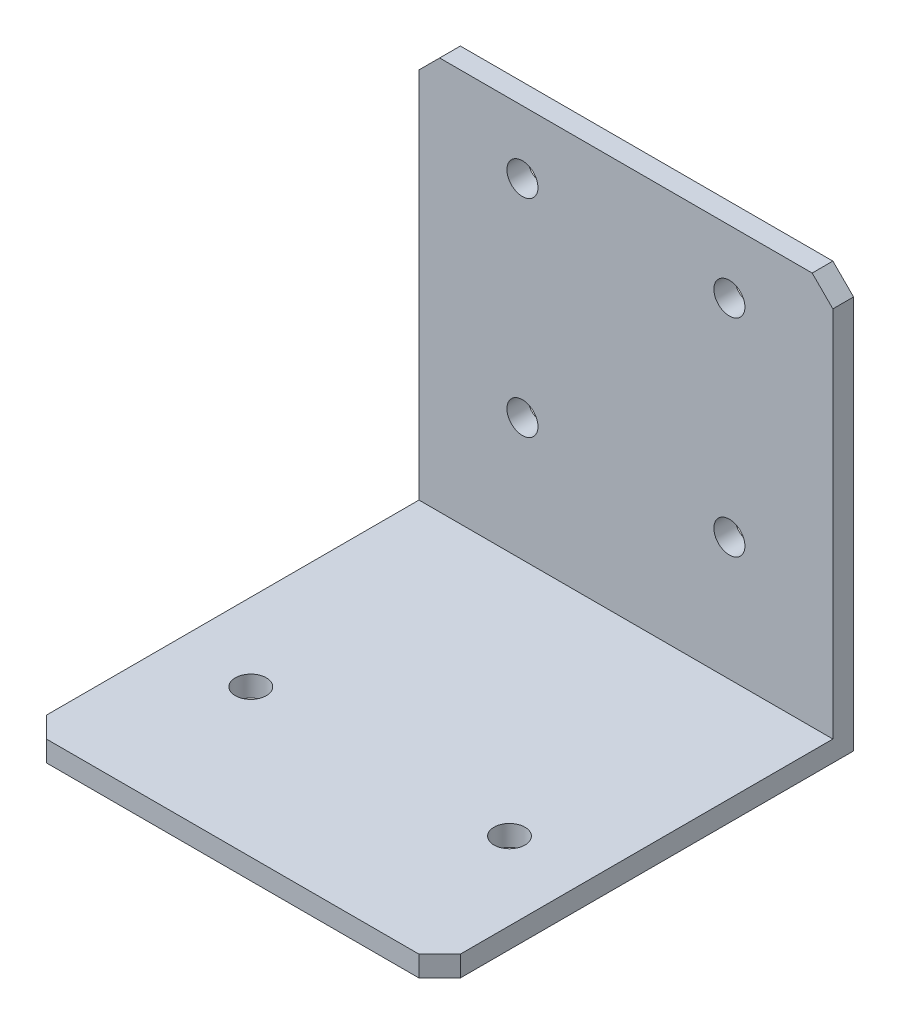
ISO-10303-21;
HEADER;
FILE_DESCRIPTION(('STEP AP214'),'2;1');
FILE_NAME('part.step','',(''),(''),'','','');
FILE_SCHEMA(('AUTOMOTIVE_DESIGN { 1 0 10303 214 1 1 1 1 }'));
ENDSEC;
DATA;
#1=APPLICATION_CONTEXT('core data for automotive mechanical design processes');
#2=APPLICATION_PROTOCOL_DEFINITION('international standard','automotive_design',2000,#1);
#3=PRODUCT_CONTEXT('',#1,'mechanical');
#4=PRODUCT('Part','Part','',(#3));
#5=PRODUCT_RELATED_PRODUCT_CATEGORY('part','',(#4));
#6=PRODUCT_DEFINITION_FORMATION('','',#4);
#7=PRODUCT_DEFINITION_CONTEXT('part definition',#1,'design');
#8=PRODUCT_DEFINITION('design','',#6,#7);
#9=PRODUCT_DEFINITION_SHAPE('','',#8);
#10=(LENGTH_UNIT() NAMED_UNIT(*) SI_UNIT(.MILLI.,.METRE.));
#11=(NAMED_UNIT(*) PLANE_ANGLE_UNIT() SI_UNIT($,.RADIAN.));
#12=(NAMED_UNIT(*) SI_UNIT($,.STERADIAN.) SOLID_ANGLE_UNIT());
#13=UNCERTAINTY_MEASURE_WITH_UNIT(LENGTH_MEASURE(1.E-05),#10,'distance_accuracy_value','');
#14=(GEOMETRIC_REPRESENTATION_CONTEXT(3) GLOBAL_UNCERTAINTY_ASSIGNED_CONTEXT((#13)) GLOBAL_UNIT_ASSIGNED_CONTEXT((#10,
#11,#12)) REPRESENTATION_CONTEXT('',''));
#15=CARTESIAN_POINT('',(0.,0.,0.));
#16=DIRECTION('',(0.,0.,1.));
#17=DIRECTION('',(1.,0.,0.));
#18=AXIS2_PLACEMENT_3D('',#15,#16,#17);
#19=CARTESIAN_POINT('',(40.,0.,38.));
#20=DIRECTION('',(0.,-1.,0.));
#21=DIRECTION('',(0.,0.,-1.));
#22=AXIS2_PLACEMENT_3D('',#19,#20,#21);
#23=PLANE('',#22);
#24=CARTESIAN_POINT('',(7.5,0.,23.75));
#25=DIRECTION('',(0.,-1.,0.));
#26=DIRECTION('',(0.,0.,-1.));
#27=AXIS2_PLACEMENT_3D('',#24,#25,#26);
#28=CIRCLE('',#27,1.49999999997635);
#29=CARTESIAN_POINT('',(7.5,0.,22.2500000000236));
#30=VERTEX_POINT('',#29);
#31=EDGE_CURVE('E213',#30,#30,#28,.F.);
#32=ORIENTED_EDGE('',*,*,#31,.F.);
#33=EDGE_LOOP('',(#32));
#34=FACE_BOUND('',#33,.T.);
#35=CARTESIAN_POINT('',(32.5,0.,23.75));
#36=DIRECTION('',(0.,-1.,0.));
#37=DIRECTION('',(0.,0.,-1.));
#38=AXIS2_PLACEMENT_3D('',#35,#36,#37);
#39=CIRCLE('',#38,1.49999999997635);
#40=CARTESIAN_POINT('',(32.5,0.,22.2500000000236));
#41=VERTEX_POINT('',#40);
#42=EDGE_CURVE('E145',#41,#41,#39,.F.);
#43=ORIENTED_EDGE('',*,*,#42,.F.);
#44=EDGE_LOOP('',(#43));
#45=FACE_BOUND('',#44,.T.);
#46=DIRECTION('',(-1.,0.,0.));
#47=VECTOR('',#46,1.);
#48=CARTESIAN_POINT('',(40.,0.,38.));
#49=LINE('',#48,#47);
#50=CARTESIAN_POINT('',(38.,0.,38.));
#51=VERTEX_POINT('',#50);
#52=CARTESIAN_POINT('',(2.00000000000001,0.,38.));
#53=VERTEX_POINT('',#52);
#54=EDGE_CURVE('E159',#51,#53,#49,.T.);
#55=ORIENTED_EDGE('',*,*,#54,.F.);
#56=DIRECTION('',(0.70710678118655,0.,-0.707106781186545));
#57=VECTOR('',#56,1.);
#58=CARTESIAN_POINT('',(40.,0.,36.));
#59=LINE('',#58,#57);
#60=CARTESIAN_POINT('',(40.,0.,36.));
#61=VERTEX_POINT('',#60);
#62=EDGE_CURVE('E176',#51,#61,#59,.T.);
#63=ORIENTED_EDGE('',*,*,#62,.T.);
#64=DIRECTION('',(0.,0.,1.));
#65=VECTOR('',#64,1.);
#66=CARTESIAN_POINT('',(40.,0.,38.));
#67=LINE('',#66,#65);
#68=CARTESIAN_POINT('',(40.,0.,0.));
#69=VERTEX_POINT('',#68);
#70=EDGE_CURVE('E123',#69,#61,#67,.T.);
#71=ORIENTED_EDGE('',*,*,#70,.F.);
#72=DIRECTION('',(-1.,0.,0.));
#73=VECTOR('',#72,1.);
#74=CARTESIAN_POINT('',(40.,0.,0.));
#75=LINE('',#74,#73);
#76=CARTESIAN_POINT('',(0.,0.,0.));
#77=VERTEX_POINT('',#76);
#78=EDGE_CURVE('E138',#69,#77,#75,.T.);
#79=ORIENTED_EDGE('',*,*,#78,.T.);
#80=DIRECTION('',(0.,0.,1.));
#81=VECTOR('',#80,1.);
#82=CARTESIAN_POINT('',(0.,0.,38.));
#83=LINE('',#82,#81);
#84=CARTESIAN_POINT('',(0.,0.,36.));
#85=VERTEX_POINT('',#84);
#86=EDGE_CURVE('E142',#77,#85,#83,.T.);
#87=ORIENTED_EDGE('',*,*,#86,.T.);
#88=DIRECTION('',(-0.707106781186545,0.,-0.70710678118655));
#89=VECTOR('',#88,1.);
#90=CARTESIAN_POINT('',(1.99999999999999,0.,38.));
#91=LINE('',#90,#89);
#92=EDGE_CURVE('E174',#85,#53,#91,.F.);
#93=ORIENTED_EDGE('',*,*,#92,.T.);
#94=EDGE_LOOP('',(#55,#63,#71,#79,#87,#93));
#95=FACE_BOUND('',#94,.T.);
#96=ADVANCED_FACE('F34',(#34,#45,#95),#23,.F.);
#97=CARTESIAN_POINT('',(40.,-2.,38.));
#98=DIRECTION('',(0.,0.,-1.));
#99=DIRECTION('',(-1.,0.,0.));
#100=AXIS2_PLACEMENT_3D('',#97,#98,#99);
#101=PLANE('',#100);
#102=DIRECTION('',(-1.,0.,0.));
#103=VECTOR('',#102,1.);
#104=CARTESIAN_POINT('',(40.,-2.,38.));
#105=LINE('',#104,#103);
#106=CARTESIAN_POINT('',(38.,-2.,38.));
#107=VERTEX_POINT('',#106);
#108=CARTESIAN_POINT('',(2.00000000000001,-2.,38.));
#109=VERTEX_POINT('',#108);
#110=EDGE_CURVE('E131',#107,#109,#105,.T.);
#111=ORIENTED_EDGE('',*,*,#110,.F.);
#112=DIRECTION('',(0.,1.,0.));
#113=VECTOR('',#112,1.);
#114=CARTESIAN_POINT('',(38.,0.,38.));
#115=LINE('',#114,#113);
#116=EDGE_CURVE('E172',#107,#51,#115,.T.);
#117=ORIENTED_EDGE('',*,*,#116,.T.);
#118=ORIENTED_EDGE('',*,*,#54,.T.);
#119=DIRECTION('',(0.,-1.,0.));
#120=VECTOR('',#119,1.);
#121=CARTESIAN_POINT('',(1.99999999999999,-2.,38.));
#122=LINE('',#121,#120);
#123=EDGE_CURVE('E169',#53,#109,#122,.T.);
#124=ORIENTED_EDGE('',*,*,#123,.T.);
#125=EDGE_LOOP('',(#111,#117,#118,#124));
#126=FACE_BOUND('',#125,.T.);
#127=ADVANCED_FACE('F277',(#126),#101,.F.);
#128=CARTESIAN_POINT('',(40.,-2.,-2.00000000000001));
#129=DIRECTION('',(0.,1.,0.));
#130=DIRECTION('',(0.,0.,1.));
#131=AXIS2_PLACEMENT_3D('',#128,#129,#130);
#132=PLANE('',#131);
#133=CARTESIAN_POINT('',(7.5,-2.,23.75));
#134=DIRECTION('',(0.,-1.,0.));
#135=DIRECTION('',(0.,0.,-1.));
#136=AXIS2_PLACEMENT_3D('',#133,#134,#135);
#137=CIRCLE('',#136,1.49999999997635);
#138=CARTESIAN_POINT('',(7.5,-2.,22.2500000000236));
#139=VERTEX_POINT('',#138);
#140=EDGE_CURVE('E216',#139,#139,#137,.T.);
#141=ORIENTED_EDGE('',*,*,#140,.F.);
#142=EDGE_LOOP('',(#141));
#143=FACE_BOUND('',#142,.T.);
#144=CARTESIAN_POINT('',(32.5,-2.,23.75));
#145=DIRECTION('',(0.,-1.,0.));
#146=DIRECTION('',(0.,0.,-1.));
#147=AXIS2_PLACEMENT_3D('',#144,#145,#146);
#148=CIRCLE('',#147,1.49999999997635);
#149=CARTESIAN_POINT('',(32.5,-2.,22.2500000000236));
#150=VERTEX_POINT('',#149);
#151=EDGE_CURVE('E210',#150,#150,#148,.T.);
#152=ORIENTED_EDGE('',*,*,#151,.F.);
#153=EDGE_LOOP('',(#152));
#154=FACE_BOUND('',#153,.T.);
#155=DIRECTION('',(0.,0.,-1.));
#156=VECTOR('',#155,1.);
#157=CARTESIAN_POINT('',(40.,-2.,-2.00000000000001));
#158=LINE('',#157,#156);
#159=CARTESIAN_POINT('',(40.,-2.,36.));
#160=VERTEX_POINT('',#159);
#161=CARTESIAN_POINT('',(40.,-2.,-2.00000000000001));
#162=VERTEX_POINT('',#161);
#163=EDGE_CURVE('E112',#160,#162,#158,.T.);
#164=ORIENTED_EDGE('',*,*,#163,.F.);
#165=DIRECTION('',(-0.70710678118655,0.,0.707106781186545));
#166=VECTOR('',#165,1.);
#167=CARTESIAN_POINT('',(40.,-2.,36.));
#168=LINE('',#167,#166);
#169=EDGE_CURVE('E167',#160,#107,#168,.T.);
#170=ORIENTED_EDGE('',*,*,#169,.T.);
#171=ORIENTED_EDGE('',*,*,#110,.T.);
#172=DIRECTION('',(0.707106781186545,0.,0.70710678118655));
#173=VECTOR('',#172,1.);
#174=CARTESIAN_POINT('',(1.99999999999999,-2.,38.));
#175=LINE('',#174,#173);
#176=CARTESIAN_POINT('',(0.,-2.,36.));
#177=VERTEX_POINT('',#176);
#178=EDGE_CURVE('E165',#109,#177,#175,.F.);
#179=ORIENTED_EDGE('',*,*,#178,.T.);
#180=DIRECTION('',(0.,0.,-1.));
#181=VECTOR('',#180,1.);
#182=CARTESIAN_POINT('',(0.,-2.,-2.00000000000001));
#183=LINE('',#182,#181);
#184=CARTESIAN_POINT('',(0.,-2.,-2.00000000000001));
#185=VERTEX_POINT('',#184);
#186=EDGE_CURVE('E129',#177,#185,#183,.T.);
#187=ORIENTED_EDGE('',*,*,#186,.T.);
#188=DIRECTION('',(-1.,0.,0.));
#189=VECTOR('',#188,1.);
#190=CARTESIAN_POINT('',(40.,-2.,-2.00000000000001));
#191=LINE('',#190,#189);
#192=EDGE_CURVE('E126',#162,#185,#191,.T.);
#193=ORIENTED_EDGE('',*,*,#192,.F.);
#194=EDGE_LOOP('',(#164,#170,#171,#179,#187,#193));
#195=FACE_BOUND('',#194,.T.);
#196=ADVANCED_FACE('F127',(#143,#154,#195),#132,.F.);
#197=CARTESIAN_POINT('',(40.,38.,-2.));
#198=DIRECTION('',(0.,0.,1.));
#199=DIRECTION('',(0.,-1.,0.));
#200=AXIS2_PLACEMENT_3D('',#197,#198,#199);
#201=PLANE('',#200);
#202=CARTESIAN_POINT('',(9.99999999999981,11.9,-2.));
#203=DIRECTION('',(0.,0.,-1.));
#204=DIRECTION('',(0.,1.,0.));
#205=AXIS2_PLACEMENT_3D('',#202,#203,#204);
#206=CIRCLE('',#205,1.5);
#207=CARTESIAN_POINT('',(9.99999999999981,13.4,-2.));
#208=VERTEX_POINT('',#207);
#209=EDGE_CURVE('E240',#208,#208,#206,.T.);
#210=ORIENTED_EDGE('',*,*,#209,.F.);
#211=EDGE_LOOP('',(#210));
#212=FACE_BOUND('',#211,.T.);
#213=CARTESIAN_POINT('',(29.9999999999998,11.8999999999999,-2.));
#214=DIRECTION('',(0.,0.,-1.));
#215=DIRECTION('',(0.,1.,0.));
#216=AXIS2_PLACEMENT_3D('',#213,#214,#215);
#217=CIRCLE('',#216,1.5);
#218=CARTESIAN_POINT('',(29.9999999999998,13.3999999999999,-2.));
#219=VERTEX_POINT('',#218);
#220=EDGE_CURVE('E234',#219,#219,#217,.T.);
#221=ORIENTED_EDGE('',*,*,#220,.F.);
#222=EDGE_LOOP('',(#221));
#223=FACE_BOUND('',#222,.T.);
#224=CARTESIAN_POINT('',(30.,31.8999999999999,-2.));
#225=DIRECTION('',(0.,0.,-1.));
#226=DIRECTION('',(0.,1.,0.));
#227=AXIS2_PLACEMENT_3D('',#224,#225,#226);
#228=CIRCLE('',#227,1.5);
#229=CARTESIAN_POINT('',(30.,33.3999999999999,-2.));
#230=VERTEX_POINT('',#229);
#231=EDGE_CURVE('E228',#230,#230,#228,.T.);
#232=ORIENTED_EDGE('',*,*,#231,.F.);
#233=EDGE_LOOP('',(#232));
#234=FACE_BOUND('',#233,.T.);
#235=CARTESIAN_POINT('',(10.,31.9,-2.));
#236=DIRECTION('',(0.,0.,-1.));
#237=DIRECTION('',(0.,1.,0.));
#238=AXIS2_PLACEMENT_3D('',#235,#236,#237);
#239=CIRCLE('',#238,1.5);
#240=CARTESIAN_POINT('',(10.,33.4,-2.));
#241=VERTEX_POINT('',#240);
#242=EDGE_CURVE('E222',#241,#241,#239,.T.);
#243=ORIENTED_EDGE('',*,*,#242,.F.);
#244=EDGE_LOOP('',(#243));
#245=FACE_BOUND('',#244,.T.);
#246=DIRECTION('',(0.,1.,0.));
#247=VECTOR('',#246,1.);
#248=CARTESIAN_POINT('',(0.,38.,-2.));
#249=LINE('',#248,#247);
#250=CARTESIAN_POINT('',(0.,36.,-2.));
#251=VERTEX_POINT('',#250);
#252=EDGE_CURVE('E147',#185,#251,#249,.T.);
#253=ORIENTED_EDGE('',*,*,#252,.T.);
#254=DIRECTION('',(-0.707106781186545,-0.70710678118655,0.));
#255=VECTOR('',#254,1.);
#256=CARTESIAN_POINT('',(1.99999999999999,38.,-2.));
#257=LINE('',#256,#255);
#258=CARTESIAN_POINT('',(2.00000000000001,38.,-2.));
#259=VERTEX_POINT('',#258);
#260=EDGE_CURVE('E11',#251,#259,#257,.F.);
#261=ORIENTED_EDGE('',*,*,#260,.T.);
#262=DIRECTION('',(-1.,0.,0.));
#263=VECTOR('',#262,1.);
#264=CARTESIAN_POINT('',(40.,38.,-2.));
#265=LINE('',#264,#263);
#266=CARTESIAN_POINT('',(38.,38.,-2.));
#267=VERTEX_POINT('',#266);
#268=EDGE_CURVE('E132',#267,#259,#265,.T.);
#269=ORIENTED_EDGE('',*,*,#268,.F.);
#270=DIRECTION('',(0.70710678118655,-0.707106781186545,0.));
#271=VECTOR('',#270,1.);
#272=CARTESIAN_POINT('',(40.,36.,-2.));
#273=LINE('',#272,#271);
#274=CARTESIAN_POINT('',(40.,36.,-2.));
#275=VERTEX_POINT('',#274);
#276=EDGE_CURVE('E42',#267,#275,#273,.T.);
#277=ORIENTED_EDGE('',*,*,#276,.T.);
#278=DIRECTION('',(0.,1.,0.));
#279=VECTOR('',#278,1.);
#280=CARTESIAN_POINT('',(40.,38.,-2.));
#281=LINE('',#280,#279);
#282=EDGE_CURVE('E118',#162,#275,#281,.T.);
#283=ORIENTED_EDGE('',*,*,#282,.F.);
#284=ORIENTED_EDGE('',*,*,#192,.T.);
#285=EDGE_LOOP('',(#253,#261,#269,#277,#283,#284));
#286=FACE_BOUND('',#285,.T.);
#287=ADVANCED_FACE('F134',(#212,#223,#234,#245,#286),#201,.F.);
#288=CARTESIAN_POINT('',(40.,38.,0.));
#289=DIRECTION('',(0.,-1.,0.));
#290=DIRECTION('',(0.,0.,-1.));
#291=AXIS2_PLACEMENT_3D('',#288,#289,#290);
#292=PLANE('',#291);
#293=ORIENTED_EDGE('',*,*,#268,.T.);
#294=DIRECTION('',(0.,0.,1.));
#295=VECTOR('',#294,1.);
#296=CARTESIAN_POINT('',(1.99999999999999,38.,0.));
#297=LINE('',#296,#295);
#298=CARTESIAN_POINT('',(2.00000000000001,38.,0.));
#299=VERTEX_POINT('',#298);
#300=EDGE_CURVE('E183',#259,#299,#297,.T.);
#301=ORIENTED_EDGE('',*,*,#300,.T.);
#302=DIRECTION('',(-1.,0.,0.));
#303=VECTOR('',#302,1.);
#304=CARTESIAN_POINT('',(40.,38.,0.));
#305=LINE('',#304,#303);
#306=CARTESIAN_POINT('',(38.,38.,0.));
#307=VERTEX_POINT('',#306);
#308=EDGE_CURVE('E153',#307,#299,#305,.T.);
#309=ORIENTED_EDGE('',*,*,#308,.F.);
#310=DIRECTION('',(0.,0.,-1.));
#311=VECTOR('',#310,1.);
#312=CARTESIAN_POINT('',(38.,38.,-2.));
#313=LINE('',#312,#311);
#314=EDGE_CURVE('E54',#307,#267,#313,.T.);
#315=ORIENTED_EDGE('',*,*,#314,.T.);
#316=EDGE_LOOP('',(#293,#301,#309,#315));
#317=FACE_BOUND('',#316,.T.);
#318=ADVANCED_FACE('F200',(#317),#292,.F.);
#319=CARTESIAN_POINT('',(40.,0.,0.));
#320=DIRECTION('',(0.,0.,-1.));
#321=DIRECTION('',(-1.,0.,0.));
#322=AXIS2_PLACEMENT_3D('',#319,#320,#321);
#323=PLANE('',#322);
#324=CARTESIAN_POINT('',(9.99999999999981,11.9,0.));
#325=DIRECTION('',(0.,0.,-1.));
#326=DIRECTION('',(-1.,0.,0.));
#327=AXIS2_PLACEMENT_3D('',#324,#325,#326);
#328=CIRCLE('',#327,1.5);
#329=CARTESIAN_POINT('',(8.4999999999998,11.9,0.));
#330=VERTEX_POINT('',#329);
#331=EDGE_CURVE('E237',#330,#330,#328,.F.);
#332=ORIENTED_EDGE('',*,*,#331,.F.);
#333=EDGE_LOOP('',(#332));
#334=FACE_BOUND('',#333,.T.);
#335=CARTESIAN_POINT('',(29.9999999999998,11.8999999999999,0.));
#336=DIRECTION('',(0.,0.,-1.));
#337=DIRECTION('',(-1.,0.,0.));
#338=AXIS2_PLACEMENT_3D('',#335,#336,#337);
#339=CIRCLE('',#338,1.5);
#340=CARTESIAN_POINT('',(28.4999999999998,11.8999999999999,0.));
#341=VERTEX_POINT('',#340);
#342=EDGE_CURVE('E231',#341,#341,#339,.F.);
#343=ORIENTED_EDGE('',*,*,#342,.F.);
#344=EDGE_LOOP('',(#343));
#345=FACE_BOUND('',#344,.T.);
#346=CARTESIAN_POINT('',(30.,31.8999999999999,0.));
#347=DIRECTION('',(0.,0.,-1.));
#348=DIRECTION('',(-1.,0.,0.));
#349=AXIS2_PLACEMENT_3D('',#346,#347,#348);
#350=CIRCLE('',#349,1.5);
#351=CARTESIAN_POINT('',(28.5,31.8999999999999,0.));
#352=VERTEX_POINT('',#351);
#353=EDGE_CURVE('E225',#352,#352,#350,.F.);
#354=ORIENTED_EDGE('',*,*,#353,.F.);
#355=EDGE_LOOP('',(#354));
#356=FACE_BOUND('',#355,.T.);
#357=CARTESIAN_POINT('',(10.,31.9,0.));
#358=DIRECTION('',(0.,0.,-1.));
#359=DIRECTION('',(-1.,0.,0.));
#360=AXIS2_PLACEMENT_3D('',#357,#358,#359);
#361=CIRCLE('',#360,1.5);
#362=CARTESIAN_POINT('',(8.50000000000001,31.9,0.));
#363=VERTEX_POINT('',#362);
#364=EDGE_CURVE('E219',#363,#363,#361,.F.);
#365=ORIENTED_EDGE('',*,*,#364,.F.);
#366=EDGE_LOOP('',(#365));
#367=FACE_BOUND('',#366,.T.);
#368=ORIENTED_EDGE('',*,*,#308,.T.);
#369=DIRECTION('',(0.707106781186545,0.70710678118655,0.));
#370=VECTOR('',#369,1.);
#371=CARTESIAN_POINT('',(1.99999999999999,38.,0.));
#372=LINE('',#371,#370);
#373=CARTESIAN_POINT('',(0.,36.,0.));
#374=VERTEX_POINT('',#373);
#375=EDGE_CURVE('E188',#299,#374,#372,.F.);
#376=ORIENTED_EDGE('',*,*,#375,.T.);
#377=DIRECTION('',(0.,-1.,0.));
#378=VECTOR('',#377,1.);
#379=CARTESIAN_POINT('',(0.,0.,0.));
#380=LINE('',#379,#378);
#381=EDGE_CURVE('E149',#374,#77,#380,.T.);
#382=ORIENTED_EDGE('',*,*,#381,.T.);
#383=ORIENTED_EDGE('',*,*,#78,.F.);
#384=DIRECTION('',(0.,-1.,0.));
#385=VECTOR('',#384,1.);
#386=CARTESIAN_POINT('',(40.,0.,0.));
#387=LINE('',#386,#385);
#388=CARTESIAN_POINT('',(40.,36.,0.));
#389=VERTEX_POINT('',#388);
#390=EDGE_CURVE('E136',#389,#69,#387,.T.);
#391=ORIENTED_EDGE('',*,*,#390,.F.);
#392=DIRECTION('',(-0.70710678118655,0.707106781186545,0.));
#393=VECTOR('',#392,1.);
#394=CARTESIAN_POINT('',(40.,36.,0.));
#395=LINE('',#394,#393);
#396=EDGE_CURVE('E186',#389,#307,#395,.T.);
#397=ORIENTED_EDGE('',*,*,#396,.T.);
#398=EDGE_LOOP('',(#368,#376,#382,#383,#391,#397));
#399=FACE_BOUND('',#398,.T.);
#400=ADVANCED_FACE('F191',(#334,#345,#356,#367,#399),#323,.F.);
#401=CARTESIAN_POINT('',(40.,0.,0.));
#402=DIRECTION('',(1.,0.,0.));
#403=DIRECTION('',(0.,0.,-1.));
#404=AXIS2_PLACEMENT_3D('',#401,#402,#403);
#405=PLANE('',#404);
#406=ORIENTED_EDGE('',*,*,#70,.T.);
#407=DIRECTION('',(0.,-1.,0.));
#408=VECTOR('',#407,1.);
#409=CARTESIAN_POINT('',(40.,-2.,36.));
#410=LINE('',#409,#408);
#411=EDGE_CURVE('E121',#61,#160,#410,.T.);
#412=ORIENTED_EDGE('',*,*,#411,.T.);
#413=ORIENTED_EDGE('',*,*,#163,.T.);
#414=ORIENTED_EDGE('',*,*,#282,.T.);
#415=DIRECTION('',(0.,0.,1.));
#416=VECTOR('',#415,1.);
#417=CARTESIAN_POINT('',(40.,36.,0.));
#418=LINE('',#417,#416);
#419=EDGE_CURVE('E162',#275,#389,#418,.T.);
#420=ORIENTED_EDGE('',*,*,#419,.T.);
#421=ORIENTED_EDGE('',*,*,#390,.T.);
#422=EDGE_LOOP('',(#406,#412,#413,#414,#420,#421));
#423=FACE_BOUND('',#422,.T.);
#424=ADVANCED_FACE('F115',(#423),#405,.T.);
#425=CARTESIAN_POINT('',(0.,0.,0.));
#426=DIRECTION('',(1.,0.,0.));
#427=DIRECTION('',(0.,0.,-1.));
#428=AXIS2_PLACEMENT_3D('',#425,#426,#427);
#429=PLANE('',#428);
#430=ORIENTED_EDGE('',*,*,#186,.F.);
#431=DIRECTION('',(0.,1.,0.));
#432=VECTOR('',#431,1.);
#433=CARTESIAN_POINT('',(0.,0.,36.));
#434=LINE('',#433,#432);
#435=EDGE_CURVE('E180',#177,#85,#434,.T.);
#436=ORIENTED_EDGE('',*,*,#435,.T.);
#437=ORIENTED_EDGE('',*,*,#86,.F.);
#438=ORIENTED_EDGE('',*,*,#381,.F.);
#439=DIRECTION('',(0.,0.,-1.));
#440=VECTOR('',#439,1.);
#441=CARTESIAN_POINT('',(0.,36.,0.));
#442=LINE('',#441,#440);
#443=EDGE_CURVE('E178',#374,#251,#442,.T.);
#444=ORIENTED_EDGE('',*,*,#443,.T.);
#445=ORIENTED_EDGE('',*,*,#252,.F.);
#446=EDGE_LOOP('',(#430,#436,#437,#438,#444,#445));
#447=FACE_BOUND('',#446,.T.);
#448=ADVANCED_FACE('F198',(#447),#429,.F.);
#449=CARTESIAN_POINT('',(32.5,38.001,23.75));
#450=DIRECTION('',(0.,-1.,0.));
#451=DIRECTION('',(0.,0.,-1.));
#452=AXIS2_PLACEMENT_3D('',#449,#450,#451);
#453=CYLINDRICAL_SURFACE('',#452,1.49999999997635);
#454=ORIENTED_EDGE('',*,*,#151,.T.);
#455=EDGE_LOOP('',(#454));
#456=FACE_BOUND('',#455,.T.);
#457=ORIENTED_EDGE('',*,*,#42,.T.);
#458=EDGE_LOOP('',(#457));
#459=FACE_BOUND('',#458,.T.);
#460=ADVANCED_FACE('F329',(#456,#459),#453,.F.);
#461=CARTESIAN_POINT('',(7.5,38.001,23.75));
#462=DIRECTION('',(0.,-1.,0.));
#463=DIRECTION('',(0.,0.,-1.));
#464=AXIS2_PLACEMENT_3D('',#461,#462,#463);
#465=CYLINDRICAL_SURFACE('',#464,1.49999999997635);
#466=ORIENTED_EDGE('',*,*,#140,.T.);
#467=EDGE_LOOP('',(#466));
#468=FACE_BOUND('',#467,.T.);
#469=ORIENTED_EDGE('',*,*,#31,.T.);
#470=EDGE_LOOP('',(#469));
#471=FACE_BOUND('',#470,.T.);
#472=ADVANCED_FACE('F260',(#468,#471),#465,.F.);
#473=CARTESIAN_POINT('',(10.,31.9,38.001));
#474=DIRECTION('',(0.,0.,-1.));
#475=DIRECTION('',(0.,1.,0.));
#476=AXIS2_PLACEMENT_3D('',#473,#474,#475);
#477=CYLINDRICAL_SURFACE('',#476,1.5);
#478=ORIENTED_EDGE('',*,*,#242,.T.);
#479=EDGE_LOOP('',(#478));
#480=FACE_BOUND('',#479,.T.);
#481=ORIENTED_EDGE('',*,*,#364,.T.);
#482=EDGE_LOOP('',(#481));
#483=FACE_BOUND('',#482,.T.);
#484=ADVANCED_FACE('F256',(#480,#483),#477,.F.);
#485=CARTESIAN_POINT('',(30.,31.8999999999999,38.001));
#486=DIRECTION('',(0.,0.,-1.));
#487=DIRECTION('',(0.,1.,0.));
#488=AXIS2_PLACEMENT_3D('',#485,#486,#487);
#489=CYLINDRICAL_SURFACE('',#488,1.5);
#490=ORIENTED_EDGE('',*,*,#231,.T.);
#491=EDGE_LOOP('',(#490));
#492=FACE_BOUND('',#491,.T.);
#493=ORIENTED_EDGE('',*,*,#353,.T.);
#494=EDGE_LOOP('',(#493));
#495=FACE_BOUND('',#494,.T.);
#496=ADVANCED_FACE('F259',(#492,#495),#489,.F.);
#497=CARTESIAN_POINT('',(29.9999999999998,11.8999999999999,38.001));
#498=DIRECTION('',(0.,0.,-1.));
#499=DIRECTION('',(0.,1.,0.));
#500=AXIS2_PLACEMENT_3D('',#497,#498,#499);
#501=CYLINDRICAL_SURFACE('',#500,1.5);
#502=ORIENTED_EDGE('',*,*,#220,.T.);
#503=EDGE_LOOP('',(#502));
#504=FACE_BOUND('',#503,.T.);
#505=ORIENTED_EDGE('',*,*,#342,.T.);
#506=EDGE_LOOP('',(#505));
#507=FACE_BOUND('',#506,.T.);
#508=ADVANCED_FACE('F377',(#504,#507),#501,.F.);
#509=CARTESIAN_POINT('',(9.99999999999981,11.9,38.001));
#510=DIRECTION('',(0.,0.,-1.));
#511=DIRECTION('',(0.,1.,0.));
#512=AXIS2_PLACEMENT_3D('',#509,#510,#511);
#513=CYLINDRICAL_SURFACE('',#512,1.5);
#514=ORIENTED_EDGE('',*,*,#209,.T.);
#515=EDGE_LOOP('',(#514));
#516=FACE_BOUND('',#515,.T.);
#517=ORIENTED_EDGE('',*,*,#331,.T.);
#518=EDGE_LOOP('',(#517));
#519=FACE_BOUND('',#518,.T.);
#520=ADVANCED_FACE('F244',(#516,#519),#513,.F.);
#521=CARTESIAN_POINT('',(40.,0.,36.));
#522=DIRECTION('',(0.707106781186545,0.,0.70710678118655));
#523=DIRECTION('',(0.,1.,0.));
#524=AXIS2_PLACEMENT_3D('',#521,#522,#523);
#525=PLANE('',#524);
#526=ORIENTED_EDGE('',*,*,#62,.F.);
#527=ORIENTED_EDGE('',*,*,#116,.F.);
#528=ORIENTED_EDGE('',*,*,#169,.F.);
#529=ORIENTED_EDGE('',*,*,#411,.F.);
#530=EDGE_LOOP('',(#526,#527,#528,#529));
#531=FACE_BOUND('',#530,.T.);
#532=ADVANCED_FACE('F289',(#531),#525,.T.);
#533=CARTESIAN_POINT('',(1.99999999999999,-2.,38.));
#534=DIRECTION('',(0.70710678118655,0.,-0.707106781186545));
#535=DIRECTION('',(0.,-1.,0.));
#536=AXIS2_PLACEMENT_3D('',#533,#534,#535);
#537=PLANE('',#536);
#538=ORIENTED_EDGE('',*,*,#92,.F.);
#539=ORIENTED_EDGE('',*,*,#435,.F.);
#540=ORIENTED_EDGE('',*,*,#178,.F.);
#541=ORIENTED_EDGE('',*,*,#123,.F.);
#542=EDGE_LOOP('',(#538,#539,#540,#541));
#543=FACE_BOUND('',#542,.T.);
#544=ADVANCED_FACE('F292',(#543),#537,.F.);
#545=CARTESIAN_POINT('',(1.99999999999999,38.,0.));
#546=DIRECTION('',(0.70710678118655,-0.707106781186545,0.));
#547=DIRECTION('',(0.,0.,1.));
#548=AXIS2_PLACEMENT_3D('',#545,#546,#547);
#549=PLANE('',#548);
#550=ORIENTED_EDGE('',*,*,#260,.F.);
#551=ORIENTED_EDGE('',*,*,#443,.F.);
#552=ORIENTED_EDGE('',*,*,#375,.F.);
#553=ORIENTED_EDGE('',*,*,#300,.F.);
#554=EDGE_LOOP('',(#550,#551,#552,#553));
#555=FACE_BOUND('',#554,.T.);
#556=ADVANCED_FACE('F199',(#555),#549,.F.);
#557=CARTESIAN_POINT('',(40.,36.,0.));
#558=DIRECTION('',(0.707106781186545,0.70710678118655,0.));
#559=DIRECTION('',(0.,0.,-1.));
#560=AXIS2_PLACEMENT_3D('',#557,#558,#559);
#561=PLANE('',#560);
#562=ORIENTED_EDGE('',*,*,#276,.F.);
#563=ORIENTED_EDGE('',*,*,#314,.F.);
#564=ORIENTED_EDGE('',*,*,#396,.F.);
#565=ORIENTED_EDGE('',*,*,#419,.F.);
#566=EDGE_LOOP('',(#562,#563,#564,#565));
#567=FACE_BOUND('',#566,.T.);
#568=ADVANCED_FACE('F36',(#567),#561,.T.);
#569=CLOSED_SHELL('',(#96,#127,#196,#287,#318,#400,#424,#448,#460,#472,#484,#496,#508,#520,#532,
#544,#556,#568));
#570=MANIFOLD_SOLID_BREP('B2',#569);
#571=ADVANCED_BREP_SHAPE_REPRESENTATION('',(#18,#570),#14);
#572=SHAPE_DEFINITION_REPRESENTATION(#9,#571);
ENDSEC;
END-ISO-10303-21;
